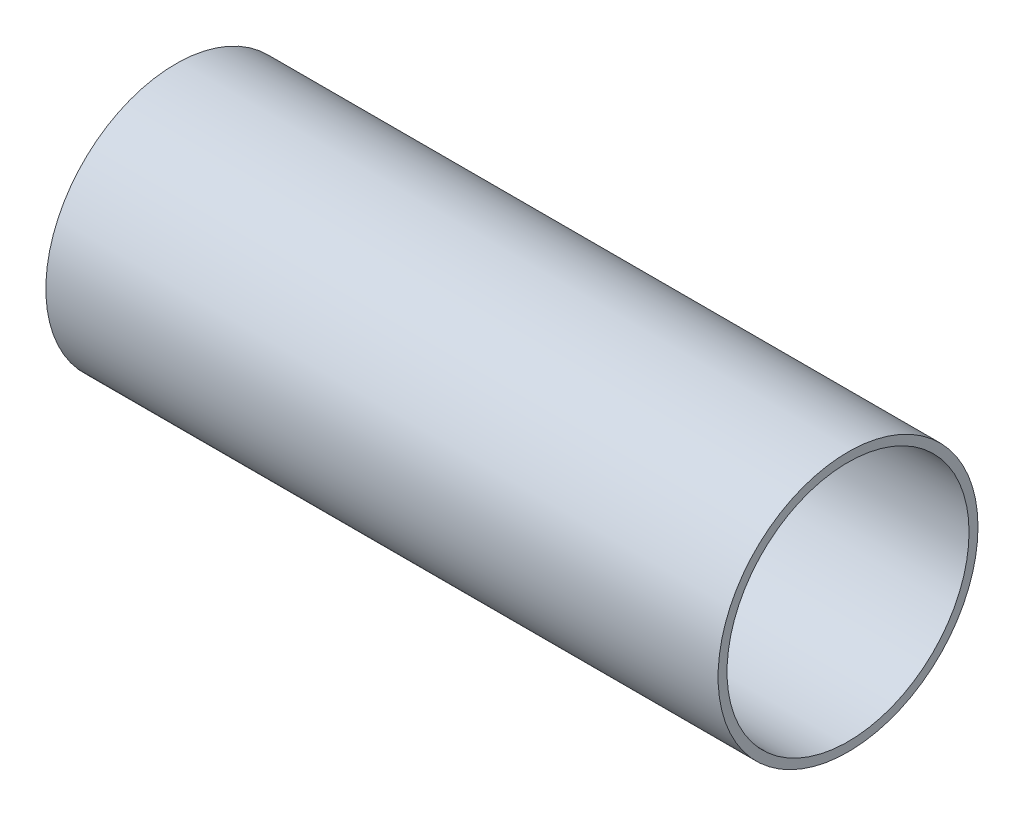
ISO-10303-21;
HEADER;
FILE_DESCRIPTION(('STEP AP214'),'2;1');
FILE_NAME('part.step','',(''),(''),'','','');
FILE_SCHEMA(('AUTOMOTIVE_DESIGN { 1 0 10303 214 1 1 1 1 }'));
ENDSEC;
DATA;
#1=APPLICATION_CONTEXT('core data for automotive mechanical design processes');
#2=APPLICATION_PROTOCOL_DEFINITION('international standard','automotive_design',2000,#1);
#3=PRODUCT_CONTEXT('',#1,'mechanical');
#4=PRODUCT('Part','Part','',(#3));
#5=PRODUCT_RELATED_PRODUCT_CATEGORY('part','',(#4));
#6=PRODUCT_DEFINITION_FORMATION('','',#4);
#7=PRODUCT_DEFINITION_CONTEXT('part definition',#1,'design');
#8=PRODUCT_DEFINITION('design','',#6,#7);
#9=PRODUCT_DEFINITION_SHAPE('','',#8);
#10=(LENGTH_UNIT() NAMED_UNIT(*) SI_UNIT(.MILLI.,.METRE.));
#11=(NAMED_UNIT(*) PLANE_ANGLE_UNIT() SI_UNIT($,.RADIAN.));
#12=(NAMED_UNIT(*) SI_UNIT($,.STERADIAN.) SOLID_ANGLE_UNIT());
#13=UNCERTAINTY_MEASURE_WITH_UNIT(LENGTH_MEASURE(1.E-05),#10,'distance_accuracy_value','');
#14=(GEOMETRIC_REPRESENTATION_CONTEXT(3) GLOBAL_UNCERTAINTY_ASSIGNED_CONTEXT((#13)) GLOBAL_UNIT_ASSIGNED_CONTEXT((#10,
#11,#12)) REPRESENTATION_CONTEXT('',''));
#15=CARTESIAN_POINT('',(0.,0.,0.));
#16=DIRECTION('',(0.,0.,1.));
#17=DIRECTION('',(1.,0.,0.));
#18=AXIS2_PLACEMENT_3D('',#15,#16,#17);
#19=CARTESIAN_POINT('',(150.,0.,0.));
#20=DIRECTION('',(1.,0.,0.));
#21=DIRECTION('',(0.,0.,-1.));
#22=AXIS2_PLACEMENT_3D('',#19,#20,#21);
#23=PLANE('',#22);
#24=CARTESIAN_POINT('',(150.,0.,0.));
#25=DIRECTION('',(1.,0.,0.));
#26=DIRECTION('',(0.,0.,-1.));
#27=AXIS2_PLACEMENT_3D('',#24,#25,#26);
#28=CIRCLE('',#27,29.);
#29=CARTESIAN_POINT('',(150.,0.,-29.));
#30=VERTEX_POINT('',#29);
#31=EDGE_CURVE('E10',#30,#30,#28,.T.);
#32=ORIENTED_EDGE('',*,*,#31,.T.);
#33=EDGE_LOOP('',(#32));
#34=FACE_BOUND('',#33,.T.);
#35=CARTESIAN_POINT('',(150.,0.,0.));
#36=DIRECTION('',(1.,0.,0.));
#37=DIRECTION('',(0.,0.,-1.));
#38=AXIS2_PLACEMENT_3D('',#35,#36,#37);
#39=CIRCLE('',#38,27.);
#40=CARTESIAN_POINT('',(150.,0.,-27.));
#41=VERTEX_POINT('',#40);
#42=EDGE_CURVE('E50',#41,#41,#39,.T.);
#43=ORIENTED_EDGE('',*,*,#42,.F.);
#44=EDGE_LOOP('',(#43));
#45=FACE_BOUND('',#44,.T.);
#46=ADVANCED_FACE('F37',(#34,#45),#23,.T.);
#47=CARTESIAN_POINT('',(0.,0.,0.));
#48=DIRECTION('',(1.,0.,0.));
#49=DIRECTION('',(0.,0.,-1.));
#50=AXIS2_PLACEMENT_3D('',#47,#48,#49);
#51=PLANE('',#50);
#52=CARTESIAN_POINT('',(0.,0.,0.));
#53=DIRECTION('',(1.,0.,0.));
#54=DIRECTION('',(0.,0.,-1.));
#55=AXIS2_PLACEMENT_3D('',#52,#53,#54);
#56=CIRCLE('',#55,29.);
#57=CARTESIAN_POINT('',(0.,0.,-29.));
#58=VERTEX_POINT('',#57);
#59=EDGE_CURVE('E41',#58,#58,#56,.T.);
#60=ORIENTED_EDGE('',*,*,#59,.F.);
#61=EDGE_LOOP('',(#60));
#62=FACE_BOUND('',#61,.T.);
#63=CARTESIAN_POINT('',(0.,0.,0.));
#64=DIRECTION('',(1.,0.,0.));
#65=DIRECTION('',(0.,0.,-1.));
#66=AXIS2_PLACEMENT_3D('',#63,#64,#65);
#67=CIRCLE('',#66,27.);
#68=CARTESIAN_POINT('',(0.,0.,-27.));
#69=VERTEX_POINT('',#68);
#70=EDGE_CURVE('E52',#69,#69,#67,.T.);
#71=ORIENTED_EDGE('',*,*,#70,.T.);
#72=EDGE_LOOP('',(#71));
#73=FACE_BOUND('',#72,.T.);
#74=ADVANCED_FACE('F64',(#62,#73),#51,.F.);
#75=CARTESIAN_POINT('',(150.,0.,0.));
#76=DIRECTION('',(-1.,0.,0.));
#77=DIRECTION('',(0.,0.,1.));
#78=AXIS2_PLACEMENT_3D('',#75,#76,#77);
#79=CYLINDRICAL_SURFACE('',#78,29.);
#80=ORIENTED_EDGE('',*,*,#31,.F.);
#81=EDGE_LOOP('',(#80));
#82=FACE_BOUND('',#81,.T.);
#83=ORIENTED_EDGE('',*,*,#59,.T.);
#84=EDGE_LOOP('',(#83));
#85=FACE_BOUND('',#84,.T.);
#86=ADVANCED_FACE('F39',(#82,#85),#79,.T.);
#87=CARTESIAN_POINT('',(150.,0.,0.));
#88=DIRECTION('',(-1.,0.,0.));
#89=DIRECTION('',(0.,0.,1.));
#90=AXIS2_PLACEMENT_3D('',#87,#88,#89);
#91=CYLINDRICAL_SURFACE('',#90,27.);
#92=ORIENTED_EDGE('',*,*,#42,.T.);
#93=EDGE_LOOP('',(#92));
#94=FACE_BOUND('',#93,.T.);
#95=ORIENTED_EDGE('',*,*,#70,.F.);
#96=EDGE_LOOP('',(#95));
#97=FACE_BOUND('',#96,.T.);
#98=ADVANCED_FACE('F60',(#94,#97),#91,.F.);
#99=CLOSED_SHELL('',(#46,#74,#86,#98));
#100=MANIFOLD_SOLID_BREP('B2',#99);
#101=ADVANCED_BREP_SHAPE_REPRESENTATION('',(#18,#100),#14);
#102=SHAPE_DEFINITION_REPRESENTATION(#9,#101);
ENDSEC;
END-ISO-10303-21;
